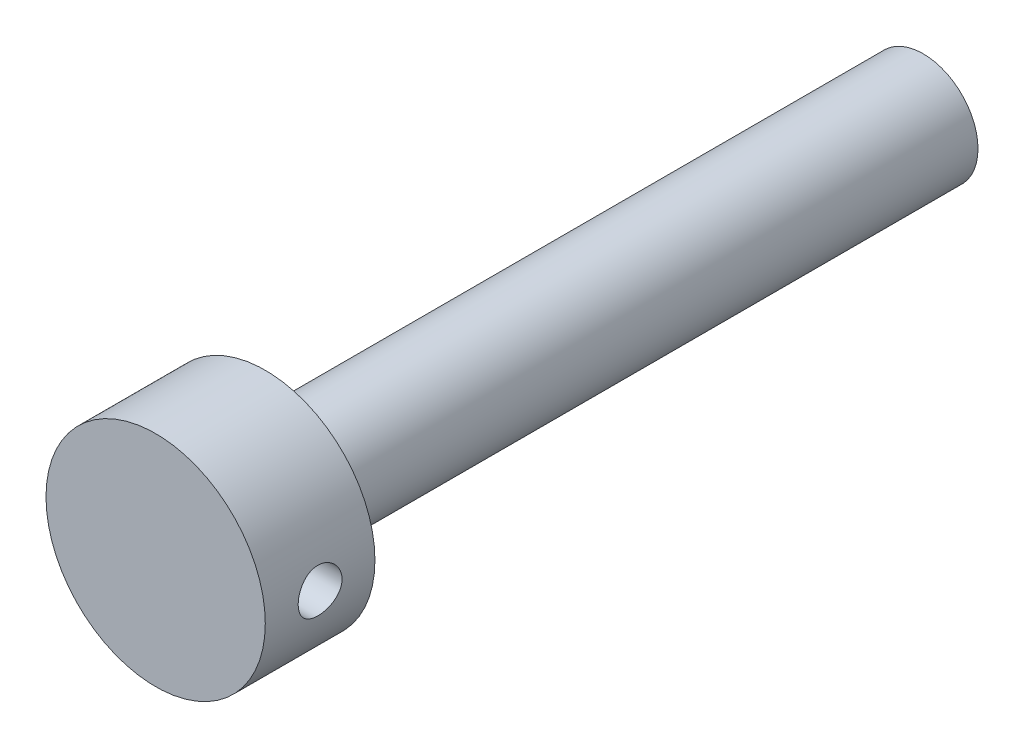
ISO-10303-21;
HEADER;
FILE_DESCRIPTION(('STEP AP214'),'2;1');
FILE_NAME('part.step','',(''),(''),'','','');
FILE_SCHEMA(('AUTOMOTIVE_DESIGN { 1 0 10303 214 1 1 1 1 }'));
ENDSEC;
DATA;
#1=APPLICATION_CONTEXT('core data for automotive mechanical design processes');
#2=APPLICATION_PROTOCOL_DEFINITION('international standard','automotive_design',2000,#1);
#3=PRODUCT_CONTEXT('',#1,'mechanical');
#4=PRODUCT('Part','Part','',(#3));
#5=PRODUCT_RELATED_PRODUCT_CATEGORY('part','',(#4));
#6=PRODUCT_DEFINITION_FORMATION('','',#4);
#7=PRODUCT_DEFINITION_CONTEXT('part definition',#1,'design');
#8=PRODUCT_DEFINITION('design','',#6,#7);
#9=PRODUCT_DEFINITION_SHAPE('','',#8);
#10=(LENGTH_UNIT() NAMED_UNIT(*) SI_UNIT(.MILLI.,.METRE.));
#11=(NAMED_UNIT(*) PLANE_ANGLE_UNIT() SI_UNIT($,.RADIAN.));
#12=(NAMED_UNIT(*) SI_UNIT($,.STERADIAN.) SOLID_ANGLE_UNIT());
#13=UNCERTAINTY_MEASURE_WITH_UNIT(LENGTH_MEASURE(1.E-05),#10,'distance_accuracy_value','');
#14=(GEOMETRIC_REPRESENTATION_CONTEXT(3) GLOBAL_UNCERTAINTY_ASSIGNED_CONTEXT((#13)) GLOBAL_UNIT_ASSIGNED_CONTEXT((#10,
#11,#12)) REPRESENTATION_CONTEXT('',''));
#15=CARTESIAN_POINT('',(0.,0.,0.));
#16=DIRECTION('',(0.,0.,1.));
#17=DIRECTION('',(1.,0.,0.));
#18=AXIS2_PLACEMENT_3D('',#15,#16,#17);
#19=CARTESIAN_POINT('',(0.,0.,30.));
#20=DIRECTION('',(0.,0.,-1.));
#21=DIRECTION('',(-1.,0.,0.));
#22=AXIS2_PLACEMENT_3D('',#19,#20,#21);
#23=CYLINDRICAL_SURFACE('',#22,5.);
#24=CARTESIAN_POINT('',(0.,0.,30.));
#25=DIRECTION('',(0.,0.,1.));
#26=DIRECTION('',(1.,0.,0.));
#27=AXIS2_PLACEMENT_3D('',#24,#25,#26);
#28=CIRCLE('',#27,5.);
#29=CARTESIAN_POINT('',(5.,0.,30.));
#30=VERTEX_POINT('',#29);
#31=EDGE_CURVE('E62',#30,#30,#28,.T.);
#32=ORIENTED_EDGE('',*,*,#31,.F.);
#33=EDGE_LOOP('',(#32));
#34=FACE_BOUND('',#33,.T.);
#35=CARTESIAN_POINT('',(0.,0.,-30.));
#36=DIRECTION('',(0.,0.,1.));
#37=DIRECTION('',(1.,0.,0.));
#38=AXIS2_PLACEMENT_3D('',#35,#36,#37);
#39=CIRCLE('',#38,5.);
#40=CARTESIAN_POINT('',(5.,0.,-30.));
#41=VERTEX_POINT('',#40);
#42=EDGE_CURVE('E66',#41,#41,#39,.T.);
#43=ORIENTED_EDGE('',*,*,#42,.T.);
#44=EDGE_LOOP('',(#43));
#45=FACE_BOUND('',#44,.T.);
#46=ADVANCED_FACE('F47',(#34,#45),#23,.T.);
#47=CARTESIAN_POINT('',(0.,0.,-30.));
#48=DIRECTION('',(0.,0.,1.));
#49=DIRECTION('',(1.,0.,0.));
#50=AXIS2_PLACEMENT_3D('',#47,#48,#49);
#51=PLANE('',#50);
#52=ORIENTED_EDGE('',*,*,#42,.F.);
#53=EDGE_LOOP('',(#52));
#54=FACE_BOUND('',#53,.T.);
#55=ADVANCED_FACE('F92',(#54),#51,.F.);
#56=CARTESIAN_POINT('',(0.,0.,40.));
#57=DIRECTION('',(0.,0.,-1.));
#58=DIRECTION('',(-1.,0.,0.));
#59=AXIS2_PLACEMENT_3D('',#56,#57,#58);
#60=CYLINDRICAL_SURFACE('',#59,10.);
#61=CARTESIAN_POINT('',(-10.,0.,33.));
#62=CARTESIAN_POINT('',(-9.99999795161742,0.111153813585266,33.0000040889967));
#63=CARTESIAN_POINT('',(-9.99812770356462,0.222359320403045,33.0092976859353));
#64=CARTESIAN_POINT('',(-9.99084731246463,0.441627015378039,33.0461970002305));
#65=CARTESIAN_POINT('',(-9.98543435720372,0.549686635082712,33.073817265603));
#66=CARTESIAN_POINT('',(-9.97167298556573,0.759460610526626,33.1464825472416));
#67=CARTESIAN_POINT('',(-9.96332738153436,0.861180935866268,33.1915108736894));
#68=CARTESIAN_POINT('',(-9.94460796070629,1.05561597772845,33.2976644950226));
#69=CARTESIAN_POINT('',(-9.93423426471414,1.14833123015163,33.3587888312144));
#70=CARTESIAN_POINT('',(-9.91244330659939,1.32338695462973,33.4962769885829));
#71=CARTESIAN_POINT('',(-9.90101491008695,1.40558790231705,33.5728167107824));
#72=CARTESIAN_POINT('',(-9.87848360905177,1.55607351321606,33.7385848327834));
#73=CARTESIAN_POINT('',(-9.86738073000847,1.62435708954085,33.8278142226702));
#74=CARTESIAN_POINT('',(-9.8466488362523,1.74566350669524,34.0174323860238));
#75=CARTESIAN_POINT('',(-9.83703414729892,1.79854187773174,34.1179152875927));
#76=CARTESIAN_POINT('',(-9.82052536116835,1.88661133316062,34.3265636380082));
#77=CARTESIAN_POINT('',(-9.81363099523923,1.92180416487448,34.4347283266927));
#78=CARTESIAN_POINT('',(-9.80345610504409,1.97305059976966,34.6541687278158));
#79=CARTESIAN_POINT('',(-9.80012940214375,1.98934899591756,34.7653850882845));
#80=CARTESIAN_POINT('',(-9.79732750121254,2.00310425545224,34.9890196427287));
#81=CARTESIAN_POINT('',(-9.79785190935681,2.000563045427,35.1014377126403));
#82=CARTESIAN_POINT('',(-9.80265102296369,1.97690914620364,35.322493576042));
#83=CARTESIAN_POINT('',(-9.80686905717527,1.95607708048781,35.4311628112546));
#84=CARTESIAN_POINT('',(-9.81849092320002,1.89687576924611,35.643432153326));
#85=CARTESIAN_POINT('',(-9.82589490715558,1.85850568620137,35.747032017838));
#86=CARTESIAN_POINT('',(-9.84311237000816,1.76504956734944,35.9470305234072));
#87=CARTESIAN_POINT('',(-9.85294179627409,1.70985230246423,36.0433757591383));
#88=CARTESIAN_POINT('',(-9.87389237546124,1.58438714914536,36.2255416999456));
#89=CARTESIAN_POINT('',(-9.88501367676732,1.51411752871366,36.3113611937023));
#90=CARTESIAN_POINT('',(-9.90754042482924,1.35899986912117,36.4716588049139));
#91=CARTESIAN_POINT('',(-9.9189473842181,1.27391232242489,36.5459051357183));
#92=CARTESIAN_POINT('',(-9.94057697428817,1.09237004812402,36.6791076926025));
#93=CARTESIAN_POINT('',(-9.95079958977947,0.995915174758778,36.7380637225872));
#94=CARTESIAN_POINT('',(-9.96893380321774,0.794118773757839,36.839055018452));
#95=CARTESIAN_POINT('',(-9.97684177696544,0.688763639170598,36.8810637872891));
#96=CARTESIAN_POINT('',(-9.98942817975716,0.472297952897328,36.9467209480771));
#97=CARTESIAN_POINT('',(-9.99410700001063,0.361188100144898,36.9703715641473));
#98=CARTESIAN_POINT('',(-9.99965343733736,0.1383588112543,36.9983129075886));
#99=CARTESIAN_POINT('',(-10.0005834930494,0.0266806566511514,37.0029208390805));
#100=CARTESIAN_POINT('',(-9.99870103860205,-0.195849868385429,36.9935002821156));
#101=CARTESIAN_POINT('',(-9.99588873882892,-0.306702284887588,36.9794728412948));
#102=CARTESIAN_POINT('',(-9.98687664016035,-0.523411319893082,36.9334432529121));
#103=CARTESIAN_POINT('',(-9.98070752808413,-0.629303896679806,36.9016038630042));
#104=CARTESIAN_POINT('',(-9.96567104122065,-0.834247254999334,36.8210320346884));
#105=CARTESIAN_POINT('',(-9.95680346428453,-0.93329752327508,36.7722983306464));
#106=CARTESIAN_POINT('',(-9.93719823066589,-1.12308234737244,36.6586350186974));
#107=CARTESIAN_POINT('',(-9.92643900874103,-1.21370025350438,36.5935144379221));
#108=CARTESIAN_POINT('',(-9.90429469659765,-1.38283603823841,36.4491816175854));
#109=CARTESIAN_POINT('',(-9.89290953936776,-1.46135261786153,36.3699678672003));
#110=CARTESIAN_POINT('',(-9.8705860711393,-1.60528118154835,36.1982532962178));
#111=CARTESIAN_POINT('',(-9.85965720466608,-1.67047540489731,36.1055685115573));
#112=CARTESIAN_POINT('',(-9.83968383592388,-1.78437084010242,35.9103772772866));
#113=CARTESIAN_POINT('',(-9.83063925826685,-1.83307271184581,35.8078712208529));
#114=CARTESIAN_POINT('',(-9.81553481168766,-1.91230368316392,35.5964635077009));
#115=CARTESIAN_POINT('',(-9.80945949744373,-1.94292699958211,35.4875983175794));
#116=CARTESIAN_POINT('',(-9.8009487358405,-1.9854173032544,35.2661330930182));
#117=CARTESIAN_POINT('',(-9.79851281382223,-1.99728673645023,35.1535335475813));
#118=CARTESIAN_POINT('',(-9.79758299262758,-2.00184182173494,34.9299822709114));
#119=CARTESIAN_POINT('',(-9.79901838378602,-1.99487157614179,34.819037702146));
#120=CARTESIAN_POINT('',(-9.80551146969228,-1.96270460820012,34.5999367001899));
#121=CARTESIAN_POINT('',(-9.81056913534338,-1.9375080322586,34.4917802446104));
#122=CARTESIAN_POINT('',(-9.82370528438317,-1.86975713699791,34.2815445775189));
#123=CARTESIAN_POINT('',(-9.83177642037661,-1.82724501343469,34.1794512789952));
#124=CARTESIAN_POINT('',(-9.85003429948341,-1.72610928920321,33.9837925585311));
#125=CARTESIAN_POINT('',(-9.86022121997788,-1.66748433754977,33.8902278525497));
#126=CARTESIAN_POINT('',(-9.88177921046451,-1.53461182957283,33.7125688556994));
#127=CARTESIAN_POINT('',(-9.89316745819399,-1.46011577447036,33.6286624694648));
#128=CARTESIAN_POINT('',(-9.91572163743909,-1.29812873802628,33.4744275889417));
#129=CARTESIAN_POINT('',(-9.92688751726369,-1.21063477430667,33.4041022193655));
#130=CARTESIAN_POINT('',(-9.94787664775943,-1.02403525817649,33.2783307121071));
#131=CARTESIAN_POINT('',(-9.95768462438492,-0.924817768859669,33.22304799344));
#132=CARTESIAN_POINT('',(-9.9747025017,-0.718332721881465,33.1300277548068));
#133=CARTESIAN_POINT('',(-9.98191474277232,-0.611072521726253,33.092274420935));
#134=CARTESIAN_POINT('',(-9.99152745190741,-0.41964297784756,33.0426961039106));
#135=CARTESIAN_POINT('',(-9.99468606316904,-0.336563328027569,33.0267136125845));
#136=CARTESIAN_POINT('',(-9.99892308279786,-0.168999050420133,33.0053641752833));
#137=CARTESIAN_POINT('',(-10.0000015574631,-0.0845144674972379,32.9999968909805));
#138=CARTESIAN_POINT('',(-10.,0.,33.));
#139=B_SPLINE_CURVE_WITH_KNOTS('',3,(#61,#62,#63,#64,#65,#66,#67,#68,#69,#70,#71,#72,#73,#74,
#75,#76,#77,#78,#79,#80,#81,#82,#83,#84,#85,#86,#87,#88,#89,#90,#91,#92,#93,#94,#95,#96,#97,#98,
#99,#100,#101,#102,#103,#104,#105,#106,#107,#108,#109,#110,#111,#112,#113,#114,#115,#116,#117,
#118,#119,#120,#121,#122,#123,#124,#125,#126,#127,#128,#129,#130,#131,#132,#133,#134,#135,#136,
#137,#138),.UNSPECIFIED.,.T.,.F.,(4,2,2,2,2,2,2,2,2,2,2,2,2,2,2,2,2,2,2,2,2,2,2,2,2,2,2,2,2,2,2,
2,2,2,2,2,2,2,4),(0.,0.333152261322517,0.666569301382647,0.999667470500684,1.33274580446173,
1.66986534022437,2.00701119349474,2.34722390011846,2.68740298730396,3.02312370207175,
3.35881008562451,3.68943454012556,4.02007478507459,4.35294980407185,4.68586309499342,
5.02476504982702,5.36367135079641,5.70310549708049,6.04249851396073,6.37621471352531,
6.70991215315736,7.04060907901447,7.37133078432046,7.70610132066718,8.04090776691861,
8.38081257158453,8.72070377446935,9.05880762065448,9.39686736660831,9.72879445135405,
10.0607188698522,10.3918392250622,10.7229873516373,11.0597615247829,11.3966130906586,
11.7369899335128,12.0770591103504,12.3303755057979,12.5836838274199),.UNSPECIFIED.);
#140=CARTESIAN_POINT('',(-10.,0.,33.));
#141=VERTEX_POINT('',#140);
#142=EDGE_CURVE('E10',#141,#141,#139,.T.);
#143=ORIENTED_EDGE('',*,*,#142,.T.);
#144=EDGE_LOOP('',(#143));
#145=FACE_BOUND('',#144,.T.);
#146=CARTESIAN_POINT('',(10.,0.,33.));
#147=CARTESIAN_POINT('',(9.99999795161742,-0.111153813585266,33.0000040889967));
#148=CARTESIAN_POINT('',(9.99812770356462,-0.222359320403045,33.0092976859353));
#149=CARTESIAN_POINT('',(9.99084731246463,-0.441627015378039,33.0461970002305));
#150=CARTESIAN_POINT('',(9.98543435720372,-0.549686635082712,33.073817265603));
#151=CARTESIAN_POINT('',(9.97167298556573,-0.759460610526626,33.1464825472416));
#152=CARTESIAN_POINT('',(9.96332738153436,-0.861180935866268,33.1915108736894));
#153=CARTESIAN_POINT('',(9.94460796070629,-1.05561597772845,33.2976644950226));
#154=CARTESIAN_POINT('',(9.93423426471414,-1.14833123015163,33.3587888312144));
#155=CARTESIAN_POINT('',(9.91244330659939,-1.32338695462973,33.4962769885829));
#156=CARTESIAN_POINT('',(9.90101491008695,-1.40558790231705,33.5728167107824));
#157=CARTESIAN_POINT('',(9.87848360905177,-1.55607351321606,33.7385848327834));
#158=CARTESIAN_POINT('',(9.86738073000847,-1.62435708954085,33.8278142226702));
#159=CARTESIAN_POINT('',(9.8466488362523,-1.74566350669524,34.0174323860238));
#160=CARTESIAN_POINT('',(9.83703414729892,-1.79854187773174,34.1179152875927));
#161=CARTESIAN_POINT('',(9.82052536116835,-1.88661133316062,34.3265636380082));
#162=CARTESIAN_POINT('',(9.81363099523923,-1.92180416487448,34.4347283266927));
#163=CARTESIAN_POINT('',(9.80345610504409,-1.97305059976966,34.6541687278158));
#164=CARTESIAN_POINT('',(9.80012940214375,-1.98934899591756,34.7653850882845));
#165=CARTESIAN_POINT('',(9.79732750121254,-2.00310425545224,34.9890196427287));
#166=CARTESIAN_POINT('',(9.79785190935681,-2.000563045427,35.1014377126403));
#167=CARTESIAN_POINT('',(9.80265102296369,-1.97690914620364,35.322493576042));
#168=CARTESIAN_POINT('',(9.80686905717527,-1.95607708048781,35.4311628112546));
#169=CARTESIAN_POINT('',(9.81849092320002,-1.89687576924611,35.643432153326));
#170=CARTESIAN_POINT('',(9.82589490715558,-1.85850568620137,35.747032017838));
#171=CARTESIAN_POINT('',(9.84311237000816,-1.76504956734944,35.9470305234072));
#172=CARTESIAN_POINT('',(9.85294179627409,-1.70985230246423,36.0433757591383));
#173=CARTESIAN_POINT('',(9.87389237546124,-1.58438714914536,36.2255416999456));
#174=CARTESIAN_POINT('',(9.88501367676732,-1.51411752871366,36.3113611937023));
#175=CARTESIAN_POINT('',(9.90754042482924,-1.35899986912117,36.4716588049139));
#176=CARTESIAN_POINT('',(9.9189473842181,-1.27391232242489,36.5459051357183));
#177=CARTESIAN_POINT('',(9.94057697428817,-1.09237004812402,36.6791076926025));
#178=CARTESIAN_POINT('',(9.95079958977947,-0.995915174758778,36.7380637225872));
#179=CARTESIAN_POINT('',(9.96893380321774,-0.794118773757839,36.839055018452));
#180=CARTESIAN_POINT('',(9.97684177696544,-0.688763639170598,36.8810637872891));
#181=CARTESIAN_POINT('',(9.98942817975716,-0.472297952897328,36.9467209480771));
#182=CARTESIAN_POINT('',(9.99410700001063,-0.361188100144898,36.9703715641473));
#183=CARTESIAN_POINT('',(9.99965343733736,-0.1383588112543,36.9983129075886));
#184=CARTESIAN_POINT('',(10.0005834930494,-0.0266806566511514,37.0029208390805));
#185=CARTESIAN_POINT('',(9.99870103860205,0.195849868385429,36.9935002821156));
#186=CARTESIAN_POINT('',(9.99588873882892,0.306702284887588,36.9794728412948));
#187=CARTESIAN_POINT('',(9.98687664016035,0.523411319893082,36.9334432529121));
#188=CARTESIAN_POINT('',(9.98070752808413,0.629303896679806,36.9016038630042));
#189=CARTESIAN_POINT('',(9.96567104122065,0.834247254999334,36.8210320346884));
#190=CARTESIAN_POINT('',(9.95680346428453,0.93329752327508,36.7722983306464));
#191=CARTESIAN_POINT('',(9.93719823066589,1.12308234737244,36.6586350186974));
#192=CARTESIAN_POINT('',(9.92643900874103,1.21370025350438,36.5935144379221));
#193=CARTESIAN_POINT('',(9.90429469659765,1.38283603823841,36.4491816175854));
#194=CARTESIAN_POINT('',(9.89290953936776,1.46135261786153,36.3699678672003));
#195=CARTESIAN_POINT('',(9.8705860711393,1.60528118154835,36.1982532962178));
#196=CARTESIAN_POINT('',(9.85965720466608,1.67047540489731,36.1055685115573));
#197=CARTESIAN_POINT('',(9.83968383592388,1.78437084010242,35.9103772772866));
#198=CARTESIAN_POINT('',(9.83063925826685,1.83307271184581,35.8078712208529));
#199=CARTESIAN_POINT('',(9.81553481168766,1.91230368316392,35.5964635077009));
#200=CARTESIAN_POINT('',(9.80945949744373,1.94292699958211,35.4875983175794));
#201=CARTESIAN_POINT('',(9.8009487358405,1.9854173032544,35.2661330930182));
#202=CARTESIAN_POINT('',(9.79851281382223,1.99728673645023,35.1535335475813));
#203=CARTESIAN_POINT('',(9.79758299262758,2.00184182173494,34.9299822709114));
#204=CARTESIAN_POINT('',(9.79901838378602,1.99487157614179,34.819037702146));
#205=CARTESIAN_POINT('',(9.80551146969228,1.96270460820012,34.5999367001899));
#206=CARTESIAN_POINT('',(9.81056913534338,1.9375080322586,34.4917802446104));
#207=CARTESIAN_POINT('',(9.82370528438317,1.86975713699791,34.2815445775189));
#208=CARTESIAN_POINT('',(9.83177642037661,1.82724501343469,34.1794512789952));
#209=CARTESIAN_POINT('',(9.85003429948341,1.72610928920321,33.9837925585311));
#210=CARTESIAN_POINT('',(9.86022121997788,1.66748433754977,33.8902278525497));
#211=CARTESIAN_POINT('',(9.88177921046451,1.53461182957283,33.7125688556994));
#212=CARTESIAN_POINT('',(9.89316745819399,1.46011577447036,33.6286624694648));
#213=CARTESIAN_POINT('',(9.91572163743909,1.29812873802628,33.4744275889417));
#214=CARTESIAN_POINT('',(9.92688751726369,1.21063477430667,33.4041022193655));
#215=CARTESIAN_POINT('',(9.94787664775943,1.02403525817649,33.2783307121071));
#216=CARTESIAN_POINT('',(9.95768462438492,0.924817768859669,33.22304799344));
#217=CARTESIAN_POINT('',(9.9747025017,0.718332721881465,33.1300277548068));
#218=CARTESIAN_POINT('',(9.98191474277232,0.611072521726253,33.092274420935));
#219=CARTESIAN_POINT('',(9.99152745190741,0.41964297784756,33.0426961039106));
#220=CARTESIAN_POINT('',(9.99468606316904,0.336563328027569,33.0267136125845));
#221=CARTESIAN_POINT('',(9.99892308279786,0.168999050420133,33.0053641752833));
#222=CARTESIAN_POINT('',(10.0000015574631,0.0845144674972379,32.9999968909805));
#223=CARTESIAN_POINT('',(10.,0.,33.));
#224=B_SPLINE_CURVE_WITH_KNOTS('',3,(#146,#147,#148,#149,#150,#151,#152,#153,#154,#155,#156,
#157,#158,#159,#160,#161,#162,#163,#164,#165,#166,#167,#168,#169,#170,#171,#172,#173,#174,#175,
#176,#177,#178,#179,#180,#181,#182,#183,#184,#185,#186,#187,#188,#189,#190,#191,#192,#193,#194,
#195,#196,#197,#198,#199,#200,#201,#202,#203,#204,#205,#206,#207,#208,#209,#210,#211,#212,#213,
#214,#215,#216,#217,#218,#219,#220,#221,#222,#223),.UNSPECIFIED.,.T.,.F.,(4,2,2,2,2,2,2,2,2,2,2,
2,2,2,2,2,2,2,2,2,2,2,2,2,2,2,2,2,2,2,2,2,2,2,2,2,2,2,4),(0.,0.333152261322517,
0.666569301382647,0.999667470500684,1.33274580446173,1.66986534022437,2.00701119349474,
2.34722390011846,2.68740298730396,3.02312370207175,3.35881008562451,3.68943454012556,
4.02007478507459,4.35294980407185,4.68586309499342,5.02476504982702,5.36367135079641,
5.70310549708049,6.04249851396073,6.37621471352531,6.70991215315736,7.04060907901447,
7.37133078432046,7.70610132066718,8.04090776691861,8.38081257158453,8.72070377446935,
9.05880762065448,9.39686736660831,9.72879445135405,10.0607188698522,10.3918392250622,
10.7229873516373,11.0597615247829,11.3966130906586,11.7369899335128,12.0770591103504,
12.3303755057979,12.5836838274199),.UNSPECIFIED.);
#225=CARTESIAN_POINT('',(10.,0.,33.));
#226=VERTEX_POINT('',#225);
#227=EDGE_CURVE('E58',#226,#226,#224,.T.);
#228=ORIENTED_EDGE('',*,*,#227,.T.);
#229=EDGE_LOOP('',(#228));
#230=FACE_BOUND('',#229,.T.);
#231=CARTESIAN_POINT('',(0.,0.,40.));
#232=DIRECTION('',(0.,0.,1.));
#233=DIRECTION('',(1.,0.,0.));
#234=AXIS2_PLACEMENT_3D('',#231,#232,#233);
#235=CIRCLE('',#234,10.);
#236=CARTESIAN_POINT('',(10.,0.,40.));
#237=VERTEX_POINT('',#236);
#238=EDGE_CURVE('E102',#237,#237,#235,.T.);
#239=ORIENTED_EDGE('',*,*,#238,.F.);
#240=EDGE_LOOP('',(#239));
#241=FACE_BOUND('',#240,.T.);
#242=CARTESIAN_POINT('',(0.,0.,30.));
#243=DIRECTION('',(0.,0.,1.));
#244=DIRECTION('',(1.,0.,0.));
#245=AXIS2_PLACEMENT_3D('',#242,#243,#244);
#246=CIRCLE('',#245,10.);
#247=CARTESIAN_POINT('',(10.,0.,30.));
#248=VERTEX_POINT('',#247);
#249=EDGE_CURVE('E104',#248,#248,#246,.T.);
#250=ORIENTED_EDGE('',*,*,#249,.T.);
#251=EDGE_LOOP('',(#250));
#252=FACE_BOUND('',#251,.T.);
#253=ADVANCED_FACE('F72',(#145,#230,#241,#252),#60,.T.);
#254=CARTESIAN_POINT('',(0.,0.,40.));
#255=DIRECTION('',(0.,0.,1.));
#256=DIRECTION('',(1.,0.,0.));
#257=AXIS2_PLACEMENT_3D('',#254,#255,#256);
#258=PLANE('',#257);
#259=ORIENTED_EDGE('',*,*,#238,.T.);
#260=EDGE_LOOP('',(#259));
#261=FACE_BOUND('',#260,.T.);
#262=ADVANCED_FACE('F81',(#261),#258,.T.);
#263=CARTESIAN_POINT('',(0.,0.,30.));
#264=DIRECTION('',(0.,0.,1.));
#265=DIRECTION('',(1.,0.,0.));
#266=AXIS2_PLACEMENT_3D('',#263,#264,#265);
#267=PLANE('',#266);
#268=ORIENTED_EDGE('',*,*,#31,.T.);
#269=EDGE_LOOP('',(#268));
#270=FACE_BOUND('',#269,.T.);
#271=ORIENTED_EDGE('',*,*,#249,.F.);
#272=EDGE_LOOP('',(#271));
#273=FACE_BOUND('',#272,.T.);
#274=ADVANCED_FACE('F79',(#270,#273),#267,.F.);
#275=CARTESIAN_POINT('',(-10.,0.,35.));
#276=DIRECTION('',(1.,0.,0.));
#277=DIRECTION('',(0.,0.,-1.));
#278=AXIS2_PLACEMENT_3D('',#275,#276,#277);
#279=CYLINDRICAL_SURFACE('',#278,2.);
#280=ORIENTED_EDGE('',*,*,#227,.F.);
#281=EDGE_LOOP('',(#280));
#282=FACE_BOUND('',#281,.T.);
#283=ORIENTED_EDGE('',*,*,#142,.F.);
#284=EDGE_LOOP('',(#283));
#285=FACE_BOUND('',#284,.T.);
#286=ADVANCED_FACE('F75',(#282,#285),#279,.F.);
#287=CLOSED_SHELL('',(#46,#55,#253,#262,#274,#286));
#288=MANIFOLD_SOLID_BREP('B2',#287);
#289=ADVANCED_BREP_SHAPE_REPRESENTATION('',(#18,#288),#14);
#290=SHAPE_DEFINITION_REPRESENTATION(#9,#289);
ENDSEC;
END-ISO-10303-21;
